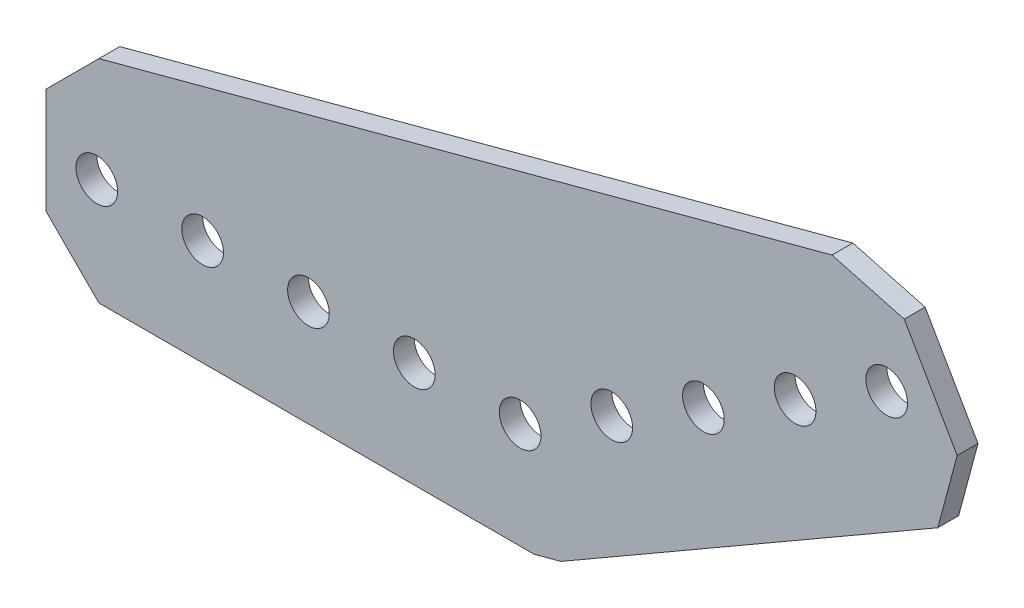
ISO-10303-21;
HEADER;
FILE_DESCRIPTION(('STEP AP214'),'2;1');
FILE_NAME('part.step','',(''),(''),'','','');
FILE_SCHEMA(('AUTOMOTIVE_DESIGN { 1 0 10303 214 1 1 1 1 }'));
ENDSEC;
DATA;
#1=APPLICATION_CONTEXT('core data for automotive mechanical design processes');
#2=APPLICATION_PROTOCOL_DEFINITION('international standard','automotive_design',2000,#1);
#3=PRODUCT_CONTEXT('',#1,'mechanical');
#4=PRODUCT('Part','Part','',(#3));
#5=PRODUCT_RELATED_PRODUCT_CATEGORY('part','',(#4));
#6=PRODUCT_DEFINITION_FORMATION('','',#4);
#7=PRODUCT_DEFINITION_CONTEXT('part definition',#1,'design');
#8=PRODUCT_DEFINITION('design','',#6,#7);
#9=PRODUCT_DEFINITION_SHAPE('','',#8);
#10=(LENGTH_UNIT() NAMED_UNIT(*) SI_UNIT(.MILLI.,.METRE.));
#11=(NAMED_UNIT(*) PLANE_ANGLE_UNIT() SI_UNIT($,.RADIAN.));
#12=(NAMED_UNIT(*) SI_UNIT($,.STERADIAN.) SOLID_ANGLE_UNIT());
#13=UNCERTAINTY_MEASURE_WITH_UNIT(LENGTH_MEASURE(1.E-05),#10,'distance_accuracy_value','');
#14=(GEOMETRIC_REPRESENTATION_CONTEXT(3) GLOBAL_UNCERTAINTY_ASSIGNED_CONTEXT((#13)) GLOBAL_UNIT_ASSIGNED_CONTEXT((#10,
#11,#12)) REPRESENTATION_CONTEXT('',''));
#15=CARTESIAN_POINT('',(0.,0.,0.));
#16=DIRECTION('',(0.,0.,1.));
#17=DIRECTION('',(1.,0.,0.));
#18=AXIS2_PLACEMENT_3D('',#15,#16,#17);
#19=CARTESIAN_POINT('',(-56.896,6.35,1.25));
#20=DIRECTION('',(-0.707106781186547,0.707106781186548,0.));
#21=DIRECTION('',(-0.707106781186548,-0.707106781186547,0.));
#22=AXIS2_PLACEMENT_3D('',#19,#20,#21);
#23=PLANE('',#22);
#24=DIRECTION('',(0.707106781186548,0.707106781186547,0.));
#25=VECTOR('',#24,1.);
#26=CARTESIAN_POINT('',(-56.896,6.35,-1.25));
#27=LINE('',#26,#25);
#28=CARTESIAN_POINT('',(-56.896,6.35,-1.25));
#29=VERTEX_POINT('',#28);
#30=CARTESIAN_POINT('',(-50.546,12.7,-1.25));
#31=VERTEX_POINT('',#30);
#32=EDGE_CURVE('E160',#29,#31,#27,.T.);
#33=ORIENTED_EDGE('',*,*,#32,.F.);
#34=DIRECTION('',(0.,0.,-1.));
#35=VECTOR('',#34,1.);
#36=CARTESIAN_POINT('',(-56.896,6.35,1.25));
#37=LINE('',#36,#35);
#38=CARTESIAN_POINT('',(-56.896,6.35,1.25));
#39=VERTEX_POINT('',#38);
#40=EDGE_CURVE('E11',#39,#29,#37,.T.);
#41=ORIENTED_EDGE('',*,*,#40,.F.);
#42=DIRECTION('',(0.707106781186548,0.707106781186547,0.));
#43=VECTOR('',#42,1.);
#44=CARTESIAN_POINT('',(-56.896,6.35,1.25));
#45=LINE('',#44,#43);
#46=CARTESIAN_POINT('',(-50.546,12.7,1.25));
#47=VERTEX_POINT('',#46);
#48=EDGE_CURVE('E197',#39,#47,#45,.T.);
#49=ORIENTED_EDGE('',*,*,#48,.T.);
#50=DIRECTION('',(0.,0.,-1.));
#51=VECTOR('',#50,1.);
#52=CARTESIAN_POINT('',(-50.546,12.7,1.25));
#53=LINE('',#52,#51);
#54=EDGE_CURVE('E48',#47,#31,#53,.T.);
#55=ORIENTED_EDGE('',*,*,#54,.T.);
#56=EDGE_LOOP('',(#33,#41,#49,#55));
#57=FACE_BOUND('',#56,.T.);
#58=ADVANCED_FACE('F45',(#57),#23,.T.);
#59=CARTESIAN_POINT('',(-56.896,-6.35,1.25));
#60=DIRECTION('',(-1.,0.,0.));
#61=DIRECTION('',(0.,0.,1.));
#62=AXIS2_PLACEMENT_3D('',#59,#60,#61);
#63=PLANE('',#62);
#64=DIRECTION('',(0.,1.,0.));
#65=VECTOR('',#64,1.);
#66=CARTESIAN_POINT('',(-56.896,-6.35,-1.25));
#67=LINE('',#66,#65);
#68=CARTESIAN_POINT('',(-56.896,-6.35,-1.25));
#69=VERTEX_POINT('',#68);
#70=EDGE_CURVE('E194',#69,#29,#67,.T.);
#71=ORIENTED_EDGE('',*,*,#70,.F.);
#72=DIRECTION('',(0.,0.,-1.));
#73=VECTOR('',#72,1.);
#74=CARTESIAN_POINT('',(-56.896,-6.35,1.25));
#75=LINE('',#74,#73);
#76=CARTESIAN_POINT('',(-56.896,-6.35,1.25));
#77=VERTEX_POINT('',#76);
#78=EDGE_CURVE('E55',#77,#69,#75,.T.);
#79=ORIENTED_EDGE('',*,*,#78,.F.);
#80=DIRECTION('',(0.,1.,0.));
#81=VECTOR('',#80,1.);
#82=CARTESIAN_POINT('',(-56.896,-6.35,1.25));
#83=LINE('',#82,#81);
#84=EDGE_CURVE('E146',#77,#39,#83,.T.);
#85=ORIENTED_EDGE('',*,*,#84,.T.);
#86=ORIENTED_EDGE('',*,*,#40,.T.);
#87=EDGE_LOOP('',(#71,#79,#85,#86));
#88=FACE_BOUND('',#87,.T.);
#89=ADVANCED_FACE('F221',(#88),#63,.T.);
#90=CARTESIAN_POINT('',(-50.546,-12.7,1.25));
#91=DIRECTION('',(-0.707106781186547,-0.707106781186548,0.));
#92=DIRECTION('',(0.707106781186548,-0.707106781186547,0.));
#93=AXIS2_PLACEMENT_3D('',#90,#91,#92);
#94=PLANE('',#93);
#95=DIRECTION('',(-0.707106781186548,0.707106781186547,0.));
#96=VECTOR('',#95,1.);
#97=CARTESIAN_POINT('',(-50.546,-12.7,-1.25));
#98=LINE('',#97,#96);
#99=CARTESIAN_POINT('',(-50.546,-12.7,-1.25));
#100=VERTEX_POINT('',#99);
#101=EDGE_CURVE('E132',#100,#69,#98,.T.);
#102=ORIENTED_EDGE('',*,*,#101,.F.);
#103=DIRECTION('',(0.,0.,-1.));
#104=VECTOR('',#103,1.);
#105=CARTESIAN_POINT('',(-50.546,-12.7,1.25));
#106=LINE('',#105,#104);
#107=CARTESIAN_POINT('',(-50.546,-12.7,1.25));
#108=VERTEX_POINT('',#107);
#109=EDGE_CURVE('E127',#108,#100,#106,.T.);
#110=ORIENTED_EDGE('',*,*,#109,.F.);
#111=DIRECTION('',(-0.707106781186548,0.707106781186547,0.));
#112=VECTOR('',#111,1.);
#113=CARTESIAN_POINT('',(-50.546,-12.7,1.25));
#114=LINE('',#113,#112);
#115=EDGE_CURVE('E130',#108,#77,#114,.T.);
#116=ORIENTED_EDGE('',*,*,#115,.T.);
#117=ORIENTED_EDGE('',*,*,#78,.T.);
#118=EDGE_LOOP('',(#102,#110,#116,#117));
#119=FACE_BOUND('',#118,.T.);
#120=ADVANCED_FACE('F129',(#119),#94,.T.);
#121=CARTESIAN_POINT('',(1.67198671935993,-12.7,1.25));
#122=DIRECTION('',(0.,-1.,0.));
#123=DIRECTION('',(0.,0.,-1.));
#124=AXIS2_PLACEMENT_3D('',#121,#122,#123);
#125=PLANE('',#124);
#126=DIRECTION('',(-1.,0.,0.));
#127=VECTOR('',#126,1.);
#128=CARTESIAN_POINT('',(1.67198671935993,-12.7,-1.25));
#129=LINE('',#128,#127);
#130=CARTESIAN_POINT('',(1.67198671935993,-12.7,-1.25));
#131=VERTEX_POINT('',#130);
#132=EDGE_CURVE('E189',#131,#100,#129,.T.);
#133=ORIENTED_EDGE('',*,*,#132,.F.);
#134=DIRECTION('',(0.,0.,-1.));
#135=VECTOR('',#134,1.);
#136=CARTESIAN_POINT('',(1.67198671935993,-12.7,1.25));
#137=LINE('',#136,#135);
#138=CARTESIAN_POINT('',(1.67198671935993,-12.7,1.25));
#139=VERTEX_POINT('',#138);
#140=EDGE_CURVE('E138',#139,#131,#137,.T.);
#141=ORIENTED_EDGE('',*,*,#140,.F.);
#142=DIRECTION('',(-1.,0.,0.));
#143=VECTOR('',#142,1.);
#144=CARTESIAN_POINT('',(1.67198671935993,-12.7,1.25));
#145=LINE('',#144,#143);
#146=EDGE_CURVE('E144',#139,#108,#145,.T.);
#147=ORIENTED_EDGE('',*,*,#146,.T.);
#148=ORIENTED_EDGE('',*,*,#109,.T.);
#149=EDGE_LOOP('',(#133,#141,#147,#148));
#150=FACE_BOUND('',#149,.T.);
#151=ADVANCED_FACE('F149',(#150),#125,.T.);
#152=CARTESIAN_POINT('',(4.9020170262441,-11.8345159877423,1.25));
#153=DIRECTION('',(0.258819045102525,-0.965925826289067,0.));
#154=DIRECTION('',(0.965925826289067,0.258819045102525,0.));
#155=AXIS2_PLACEMENT_3D('',#152,#153,#154);
#156=PLANE('',#155);
#157=DIRECTION('',(-0.965925826289067,-0.258819045102525,0.));
#158=VECTOR('',#157,1.);
#159=CARTESIAN_POINT('',(4.9020170262441,-11.8345159877423,-1.25));
#160=LINE('',#159,#158);
#161=CARTESIAN_POINT('',(4.9020170262441,-11.8345159877423,-1.25));
#162=VERTEX_POINT('',#161);
#163=EDGE_CURVE('E185',#162,#131,#160,.T.);
#164=ORIENTED_EDGE('',*,*,#163,.F.);
#165=DIRECTION('',(0.,0.,-1.));
#166=VECTOR('',#165,1.);
#167=CARTESIAN_POINT('',(4.9020170262441,-11.8345159877423,1.25));
#168=LINE('',#167,#166);
#169=CARTESIAN_POINT('',(4.9020170262441,-11.8345159877423,1.25));
#170=VERTEX_POINT('',#169);
#171=EDGE_CURVE('E203',#170,#162,#168,.T.);
#172=ORIENTED_EDGE('',*,*,#171,.F.);
#173=DIRECTION('',(-0.965925826289067,-0.258819045102525,0.));
#174=VECTOR('',#173,1.);
#175=CARTESIAN_POINT('',(4.9020170262441,-11.8345159877423,1.25));
#176=LINE('',#175,#174);
#177=EDGE_CURVE('E151',#170,#139,#176,.T.);
#178=ORIENTED_EDGE('',*,*,#177,.T.);
#179=ORIENTED_EDGE('',*,*,#140,.T.);
#180=EDGE_LOOP('',(#164,#172,#178,#179));
#181=FACE_BOUND('',#180,.T.);
#182=ADVANCED_FACE('F234',(#181),#156,.T.);
#183=CARTESIAN_POINT('',(50.1241200596882,14.2744773719375,1.25));
#184=DIRECTION('',(0.499999999999999,-0.866025403784439,0.));
#185=DIRECTION('',(0.866025403784439,0.499999999999999,0.));
#186=AXIS2_PLACEMENT_3D('',#183,#184,#185);
#187=PLANE('',#186);
#188=DIRECTION('',(-0.866025403784439,-0.499999999999999,0.));
#189=VECTOR('',#188,1.);
#190=CARTESIAN_POINT('',(50.1241200596882,14.2744773719375,-1.25));
#191=LINE('',#190,#189);
#192=CARTESIAN_POINT('',(50.1241200596882,14.2744773719375,-1.25));
#193=VERTEX_POINT('',#192);
#194=EDGE_CURVE('E181',#193,#162,#191,.T.);
#195=ORIENTED_EDGE('',*,*,#194,.F.);
#196=DIRECTION('',(0.,0.,-1.));
#197=VECTOR('',#196,1.);
#198=CARTESIAN_POINT('',(50.1241200596882,14.2744773719375,1.25));
#199=LINE('',#198,#197);
#200=CARTESIAN_POINT('',(50.1241200596882,14.2744773719375,1.25));
#201=VERTEX_POINT('',#200);
#202=EDGE_CURVE('E206',#201,#193,#199,.T.);
#203=ORIENTED_EDGE('',*,*,#202,.F.);
#204=DIRECTION('',(-0.866025403784439,-0.499999999999999,0.));
#205=VECTOR('',#204,1.);
#206=CARTESIAN_POINT('',(50.1241200596882,14.2744773719375,1.25));
#207=LINE('',#206,#205);
#208=EDGE_CURVE('E154',#201,#170,#207,.T.);
#209=ORIENTED_EDGE('',*,*,#208,.T.);
#210=ORIENTED_EDGE('',*,*,#171,.T.);
#211=EDGE_LOOP('',(#195,#203,#209,#210));
#212=FACE_BOUND('',#211,.T.);
#213=ADVANCED_FACE('F237',(#212),#187,.T.);
#214=CARTESIAN_POINT('',(52.4483813737192,22.9487386859688,1.25));
#215=DIRECTION('',(0.965925826289075,-0.258819045102496,0.));
#216=DIRECTION('',(0.258819045102496,0.965925826289075,0.));
#217=AXIS2_PLACEMENT_3D('',#214,#215,#216);
#218=PLANE('',#217);
#219=DIRECTION('',(-0.258819045102496,-0.965925826289075,0.));
#220=VECTOR('',#219,1.);
#221=CARTESIAN_POINT('',(52.4483813737192,22.9487386859688,-1.25));
#222=LINE('',#221,#220);
#223=CARTESIAN_POINT('',(52.4483813737192,22.9487386859688,-1.25));
#224=VERTEX_POINT('',#223);
#225=EDGE_CURVE('E177',#224,#193,#222,.T.);
#226=ORIENTED_EDGE('',*,*,#225,.F.);
#227=DIRECTION('',(0.,0.,-1.));
#228=VECTOR('',#227,1.);
#229=CARTESIAN_POINT('',(52.4483813737192,22.9487386859688,1.25));
#230=LINE('',#229,#228);
#231=CARTESIAN_POINT('',(52.4483813737192,22.9487386859688,1.25));
#232=VERTEX_POINT('',#231);
#233=EDGE_CURVE('E209',#232,#224,#230,.T.);
#234=ORIENTED_EDGE('',*,*,#233,.F.);
#235=DIRECTION('',(-0.258819045102496,-0.965925826289075,0.));
#236=VECTOR('',#235,1.);
#237=CARTESIAN_POINT('',(52.4483813737192,22.9487386859688,1.25));
#238=LINE('',#237,#236);
#239=EDGE_CURVE('E389',#232,#201,#238,.T.);
#240=ORIENTED_EDGE('',*,*,#239,.T.);
#241=ORIENTED_EDGE('',*,*,#202,.T.);
#242=EDGE_LOOP('',(#226,#234,#240,#241));
#243=FACE_BOUND('',#242,.T.);
#244=ADVANCED_FACE('F241',(#243),#218,.T.);
#245=CARTESIAN_POINT('',(46.0983813737194,33.9472613140308,1.25));
#246=DIRECTION('',(0.86602540378444,0.499999999999998,0.));
#247=DIRECTION('',(-0.499999999999998,0.86602540378444,0.));
#248=AXIS2_PLACEMENT_3D('',#245,#246,#247);
#249=PLANE('',#248);
#250=DIRECTION('',(0.499999999999998,-0.86602540378444,0.));
#251=VECTOR('',#250,1.);
#252=CARTESIAN_POINT('',(46.0983813737194,33.9472613140308,-1.25));
#253=LINE('',#252,#251);
#254=CARTESIAN_POINT('',(46.0983813737194,33.9472613140308,-1.25));
#255=VERTEX_POINT('',#254);
#256=EDGE_CURVE('E173',#255,#224,#253,.T.);
#257=ORIENTED_EDGE('',*,*,#256,.F.);
#258=DIRECTION('',(0.,0.,-1.));
#259=VECTOR('',#258,1.);
#260=CARTESIAN_POINT('',(46.0983813737194,33.9472613140308,1.25));
#261=LINE('',#260,#259);
#262=CARTESIAN_POINT('',(46.0983813737194,33.9472613140308,1.25));
#263=VERTEX_POINT('',#262);
#264=EDGE_CURVE('E212',#263,#255,#261,.T.);
#265=ORIENTED_EDGE('',*,*,#264,.F.);
#266=DIRECTION('',(0.499999999999998,-0.86602540378444,0.));
#267=VECTOR('',#266,1.);
#268=CARTESIAN_POINT('',(46.0983813737194,33.9472613140308,1.25));
#269=LINE('',#268,#267);
#270=EDGE_CURVE('E385',#263,#232,#269,.T.);
#271=ORIENTED_EDGE('',*,*,#270,.T.);
#272=ORIENTED_EDGE('',*,*,#233,.T.);
#273=EDGE_LOOP('',(#257,#265,#271,#272));
#274=FACE_BOUND('',#273,.T.);
#275=ADVANCED_FACE('F245',(#274),#249,.T.);
#276=CARTESIAN_POINT('',(37.4241200596881,36.2715226280624,1.25));
#277=DIRECTION('',(0.258819045102561,0.965925826289058,0.));
#278=DIRECTION('',(-0.965925826289058,0.258819045102561,0.));
#279=AXIS2_PLACEMENT_3D('',#276,#277,#278);
#280=PLANE('',#279);
#281=DIRECTION('',(0.965925826289058,-0.258819045102561,0.));
#282=VECTOR('',#281,1.);
#283=CARTESIAN_POINT('',(37.4241200596881,36.2715226280624,-1.25));
#284=LINE('',#283,#282);
#285=CARTESIAN_POINT('',(37.4241200596881,36.2715226280624,-1.25));
#286=VERTEX_POINT('',#285);
#287=EDGE_CURVE('E169',#286,#255,#284,.T.);
#288=ORIENTED_EDGE('',*,*,#287,.F.);
#289=DIRECTION('',(0.,0.,-1.));
#290=VECTOR('',#289,1.);
#291=CARTESIAN_POINT('',(37.4241200596881,36.2715226280624,1.25));
#292=LINE('',#291,#290);
#293=CARTESIAN_POINT('',(37.4241200596881,36.2715226280624,1.25));
#294=VERTEX_POINT('',#293);
#295=EDGE_CURVE('E214',#294,#286,#292,.T.);
#296=ORIENTED_EDGE('',*,*,#295,.F.);
#297=DIRECTION('',(0.965925826289058,-0.258819045102561,0.));
#298=VECTOR('',#297,1.);
#299=CARTESIAN_POINT('',(37.4241200596881,36.2715226280624,1.25));
#300=LINE('',#299,#298);
#301=EDGE_CURVE('E381',#294,#263,#300,.T.);
#302=ORIENTED_EDGE('',*,*,#301,.T.);
#303=ORIENTED_EDGE('',*,*,#264,.T.);
#304=EDGE_LOOP('',(#288,#296,#302,#303));
#305=FACE_BOUND('',#304,.T.);
#306=ADVANCED_FACE('F249',(#305),#280,.T.);
#307=CARTESIAN_POINT('',(-50.546,12.7,1.25));
#308=DIRECTION('',(-0.258819045102521,0.965925826289068,0.));
#309=DIRECTION('',(-0.965925826289068,-0.258819045102521,0.));
#310=AXIS2_PLACEMENT_3D('',#307,#308,#309);
#311=PLANE('',#310);
#312=DIRECTION('',(0.965925826289068,0.258819045102521,0.));
#313=VECTOR('',#312,1.);
#314=CARTESIAN_POINT('',(-50.546,12.7,-1.25));
#315=LINE('',#314,#313);
#316=EDGE_CURVE('E164',#31,#286,#315,.T.);
#317=ORIENTED_EDGE('',*,*,#316,.F.);
#318=ORIENTED_EDGE('',*,*,#54,.F.);
#319=DIRECTION('',(0.965925826289068,0.258819045102521,0.));
#320=VECTOR('',#319,1.);
#321=CARTESIAN_POINT('',(-50.546,12.7,1.25));
#322=LINE('',#321,#320);
#323=EDGE_CURVE('E378',#47,#294,#322,.T.);
#324=ORIENTED_EDGE('',*,*,#323,.T.);
#325=ORIENTED_EDGE('',*,*,#295,.T.);
#326=EDGE_LOOP('',(#317,#318,#324,#325));
#327=FACE_BOUND('',#326,.T.);
#328=ADVANCED_FACE('F218',(#327),#311,.T.);
#329=CARTESIAN_POINT('',(0.,0.,1.25));
#330=DIRECTION('',(0.,0.,1.));
#331=DIRECTION('',(1.,0.,0.));
#332=AXIS2_PLACEMENT_3D('',#329,#330,#331);
#333=PLANE('',#332);
#334=CARTESIAN_POINT('',(10.9985226280624,6.35,1.25));
#335=DIRECTION('',(0.,0.,-1.));
#336=DIRECTION('',(1.,0.,0.));
#337=AXIS2_PLACEMENT_3D('',#334,#335,#336);
#338=CIRCLE('',#337,2.5);
#339=CARTESIAN_POINT('',(13.4985226280624,6.35,1.25));
#340=VERTEX_POINT('',#339);
#341=EDGE_CURVE('E304',#340,#340,#338,.T.);
#342=ORIENTED_EDGE('',*,*,#341,.T.);
#343=EDGE_LOOP('',(#342));
#344=FACE_BOUND('',#343,.T.);
#345=CARTESIAN_POINT('',(21.9970452561247,12.7,1.25));
#346=DIRECTION('',(0.,0.,-1.));
#347=DIRECTION('',(1.,0.,0.));
#348=AXIS2_PLACEMENT_3D('',#345,#346,#347);
#349=CIRCLE('',#348,2.5);
#350=CARTESIAN_POINT('',(24.4970452561247,12.7,1.25));
#351=VERTEX_POINT('',#350);
#352=EDGE_CURVE('E314',#351,#351,#349,.T.);
#353=ORIENTED_EDGE('',*,*,#352,.T.);
#354=EDGE_LOOP('',(#353));
#355=FACE_BOUND('',#354,.T.);
#356=CARTESIAN_POINT('',(32.9955678841872,19.05,1.25));
#357=DIRECTION('',(0.,0.,-1.));
#358=DIRECTION('',(1.,0.,0.));
#359=AXIS2_PLACEMENT_3D('',#356,#357,#358);
#360=CIRCLE('',#359,2.5);
#361=CARTESIAN_POINT('',(35.4955678841872,19.05,1.25));
#362=VERTEX_POINT('',#361);
#363=EDGE_CURVE('E322',#362,#362,#360,.T.);
#364=ORIENTED_EDGE('',*,*,#363,.T.);
#365=EDGE_LOOP('',(#364));
#366=FACE_BOUND('',#365,.T.);
#367=CARTESIAN_POINT('',(43.9940905122495,25.4,1.25));
#368=DIRECTION('',(0.,0.,-1.));
#369=DIRECTION('',(1.,0.,0.));
#370=AXIS2_PLACEMENT_3D('',#367,#368,#369);
#371=CIRCLE('',#370,2.5);
#372=CARTESIAN_POINT('',(46.4940905122495,25.4,1.25));
#373=VERTEX_POINT('',#372);
#374=EDGE_CURVE('E330',#373,#373,#371,.T.);
#375=ORIENTED_EDGE('',*,*,#374,.T.);
#376=EDGE_LOOP('',(#375));
#377=FACE_BOUND('',#376,.T.);
#378=CARTESIAN_POINT('',(-38.1,0.,1.25));
#379=DIRECTION('',(0.,0.,-1.));
#380=DIRECTION('',(1.,0.,0.));
#381=AXIS2_PLACEMENT_3D('',#378,#379,#380);
#382=CIRCLE('',#381,2.5);
#383=CARTESIAN_POINT('',(-35.6,0.,1.25));
#384=VERTEX_POINT('',#383);
#385=EDGE_CURVE('E338',#384,#384,#382,.T.);
#386=ORIENTED_EDGE('',*,*,#385,.T.);
#387=EDGE_LOOP('',(#386));
#388=FACE_BOUND('',#387,.T.);
#389=CARTESIAN_POINT('',(-50.8,0.,1.25));
#390=DIRECTION('',(0.,0.,-1.));
#391=DIRECTION('',(1.,0.,0.));
#392=AXIS2_PLACEMENT_3D('',#389,#390,#391);
#393=CIRCLE('',#392,2.5);
#394=CARTESIAN_POINT('',(-48.3,0.,1.25));
#395=VERTEX_POINT('',#394);
#396=EDGE_CURVE('E346',#395,#395,#393,.T.);
#397=ORIENTED_EDGE('',*,*,#396,.T.);
#398=EDGE_LOOP('',(#397));
#399=FACE_BOUND('',#398,.T.);
#400=CARTESIAN_POINT('',(0.,0.,1.25));
#401=DIRECTION('',(0.,0.,-1.));
#402=DIRECTION('',(1.,0.,0.));
#403=AXIS2_PLACEMENT_3D('',#400,#401,#402);
#404=CIRCLE('',#403,2.5);
#405=CARTESIAN_POINT('',(2.5,0.,1.25));
#406=VERTEX_POINT('',#405);
#407=EDGE_CURVE('E354',#406,#406,#404,.T.);
#408=ORIENTED_EDGE('',*,*,#407,.T.);
#409=EDGE_LOOP('',(#408));
#410=FACE_BOUND('',#409,.T.);
#411=CARTESIAN_POINT('',(-25.4,0.,1.25));
#412=DIRECTION('',(0.,0.,-1.));
#413=DIRECTION('',(1.,0.,0.));
#414=AXIS2_PLACEMENT_3D('',#411,#412,#413);
#415=CIRCLE('',#414,2.5);
#416=CARTESIAN_POINT('',(-22.9,0.,1.25));
#417=VERTEX_POINT('',#416);
#418=EDGE_CURVE('E362',#417,#417,#415,.T.);
#419=ORIENTED_EDGE('',*,*,#418,.T.);
#420=EDGE_LOOP('',(#419));
#421=FACE_BOUND('',#420,.T.);
#422=CARTESIAN_POINT('',(-12.7,0.,1.25));
#423=DIRECTION('',(0.,0.,-1.));
#424=DIRECTION('',(1.,0.,0.));
#425=AXIS2_PLACEMENT_3D('',#422,#423,#424);
#426=CIRCLE('',#425,2.5);
#427=CARTESIAN_POINT('',(-10.2,0.,1.25));
#428=VERTEX_POINT('',#427);
#429=EDGE_CURVE('E165',#428,#428,#426,.T.);
#430=ORIENTED_EDGE('',*,*,#429,.T.);
#431=EDGE_LOOP('',(#430));
#432=FACE_BOUND('',#431,.T.);
#433=ORIENTED_EDGE('',*,*,#48,.F.);
#434=ORIENTED_EDGE('',*,*,#84,.F.);
#435=ORIENTED_EDGE('',*,*,#115,.F.);
#436=ORIENTED_EDGE('',*,*,#146,.F.);
#437=ORIENTED_EDGE('',*,*,#177,.F.);
#438=ORIENTED_EDGE('',*,*,#208,.F.);
#439=ORIENTED_EDGE('',*,*,#239,.F.);
#440=ORIENTED_EDGE('',*,*,#270,.F.);
#441=ORIENTED_EDGE('',*,*,#301,.F.);
#442=ORIENTED_EDGE('',*,*,#323,.F.);
#443=EDGE_LOOP('',(#433,#434,#435,#436,#437,#438,#439,#440,#441,#442));
#444=FACE_BOUND('',#443,.T.);
#445=ADVANCED_FACE('F142',(#344,#355,#366,#377,#388,#399,#410,#421,#432,#444),#333,.T.);
#446=CARTESIAN_POINT('',(0.,0.,-1.25));
#447=DIRECTION('',(0.,0.,1.));
#448=DIRECTION('',(1.,0.,0.));
#449=AXIS2_PLACEMENT_3D('',#446,#447,#448);
#450=PLANE('',#449);
#451=CARTESIAN_POINT('',(10.9985226280624,6.35,-1.25));
#452=DIRECTION('',(0.,0.,-1.));
#453=DIRECTION('',(1.,0.,0.));
#454=AXIS2_PLACEMENT_3D('',#451,#452,#453);
#455=CIRCLE('',#454,2.5);
#456=CARTESIAN_POINT('',(13.4985226280624,6.35,-1.25));
#457=VERTEX_POINT('',#456);
#458=EDGE_CURVE('E307',#457,#457,#455,.T.);
#459=ORIENTED_EDGE('',*,*,#458,.F.);
#460=EDGE_LOOP('',(#459));
#461=FACE_BOUND('',#460,.T.);
#462=CARTESIAN_POINT('',(21.9970452561247,12.7,-1.25));
#463=DIRECTION('',(0.,0.,-1.));
#464=DIRECTION('',(1.,0.,0.));
#465=AXIS2_PLACEMENT_3D('',#462,#463,#464);
#466=CIRCLE('',#465,2.5);
#467=CARTESIAN_POINT('',(24.4970452561247,12.7,-1.25));
#468=VERTEX_POINT('',#467);
#469=EDGE_CURVE('E311',#468,#468,#466,.T.);
#470=ORIENTED_EDGE('',*,*,#469,.F.);
#471=EDGE_LOOP('',(#470));
#472=FACE_BOUND('',#471,.T.);
#473=CARTESIAN_POINT('',(32.9955678841872,19.05,-1.25));
#474=DIRECTION('',(0.,0.,-1.));
#475=DIRECTION('',(1.,0.,0.));
#476=AXIS2_PLACEMENT_3D('',#473,#474,#475);
#477=CIRCLE('',#476,2.5);
#478=CARTESIAN_POINT('',(35.4955678841872,19.05,-1.25));
#479=VERTEX_POINT('',#478);
#480=EDGE_CURVE('E318',#479,#479,#477,.T.);
#481=ORIENTED_EDGE('',*,*,#480,.F.);
#482=EDGE_LOOP('',(#481));
#483=FACE_BOUND('',#482,.T.);
#484=CARTESIAN_POINT('',(43.9940905122495,25.4,-1.25));
#485=DIRECTION('',(0.,0.,-1.));
#486=DIRECTION('',(1.,0.,0.));
#487=AXIS2_PLACEMENT_3D('',#484,#485,#486);
#488=CIRCLE('',#487,2.5);
#489=CARTESIAN_POINT('',(46.4940905122495,25.4,-1.25));
#490=VERTEX_POINT('',#489);
#491=EDGE_CURVE('E326',#490,#490,#488,.T.);
#492=ORIENTED_EDGE('',*,*,#491,.F.);
#493=EDGE_LOOP('',(#492));
#494=FACE_BOUND('',#493,.T.);
#495=CARTESIAN_POINT('',(-38.1,0.,-1.25));
#496=DIRECTION('',(0.,0.,-1.));
#497=DIRECTION('',(1.,0.,0.));
#498=AXIS2_PLACEMENT_3D('',#495,#496,#497);
#499=CIRCLE('',#498,2.5);
#500=CARTESIAN_POINT('',(-35.6,0.,-1.25));
#501=VERTEX_POINT('',#500);
#502=EDGE_CURVE('E334',#501,#501,#499,.T.);
#503=ORIENTED_EDGE('',*,*,#502,.F.);
#504=EDGE_LOOP('',(#503));
#505=FACE_BOUND('',#504,.T.);
#506=CARTESIAN_POINT('',(-50.8,0.,-1.25));
#507=DIRECTION('',(0.,0.,-1.));
#508=DIRECTION('',(1.,0.,0.));
#509=AXIS2_PLACEMENT_3D('',#506,#507,#508);
#510=CIRCLE('',#509,2.5);
#511=CARTESIAN_POINT('',(-48.3,0.,-1.25));
#512=VERTEX_POINT('',#511);
#513=EDGE_CURVE('E342',#512,#512,#510,.T.);
#514=ORIENTED_EDGE('',*,*,#513,.F.);
#515=EDGE_LOOP('',(#514));
#516=FACE_BOUND('',#515,.T.);
#517=CARTESIAN_POINT('',(0.,0.,-1.25));
#518=DIRECTION('',(0.,0.,-1.));
#519=DIRECTION('',(1.,0.,0.));
#520=AXIS2_PLACEMENT_3D('',#517,#518,#519);
#521=CIRCLE('',#520,2.5);
#522=CARTESIAN_POINT('',(2.5,0.,-1.25));
#523=VERTEX_POINT('',#522);
#524=EDGE_CURVE('E350',#523,#523,#521,.T.);
#525=ORIENTED_EDGE('',*,*,#524,.F.);
#526=EDGE_LOOP('',(#525));
#527=FACE_BOUND('',#526,.T.);
#528=CARTESIAN_POINT('',(-25.4,0.,-1.25));
#529=DIRECTION('',(0.,0.,-1.));
#530=DIRECTION('',(1.,0.,0.));
#531=AXIS2_PLACEMENT_3D('',#528,#529,#530);
#532=CIRCLE('',#531,2.5);
#533=CARTESIAN_POINT('',(-22.9,0.,-1.25));
#534=VERTEX_POINT('',#533);
#535=EDGE_CURVE('E358',#534,#534,#532,.T.);
#536=ORIENTED_EDGE('',*,*,#535,.F.);
#537=EDGE_LOOP('',(#536));
#538=FACE_BOUND('',#537,.T.);
#539=CARTESIAN_POINT('',(-12.7,0.,-1.25));
#540=DIRECTION('',(0.,0.,-1.));
#541=DIRECTION('',(1.,0.,0.));
#542=AXIS2_PLACEMENT_3D('',#539,#540,#541);
#543=CIRCLE('',#542,2.5);
#544=CARTESIAN_POINT('',(-10.2,0.,-1.25));
#545=VERTEX_POINT('',#544);
#546=EDGE_CURVE('E366',#545,#545,#543,.T.);
#547=ORIENTED_EDGE('',*,*,#546,.F.);
#548=EDGE_LOOP('',(#547));
#549=FACE_BOUND('',#548,.T.);
#550=ORIENTED_EDGE('',*,*,#32,.T.);
#551=ORIENTED_EDGE('',*,*,#316,.T.);
#552=ORIENTED_EDGE('',*,*,#287,.T.);
#553=ORIENTED_EDGE('',*,*,#256,.T.);
#554=ORIENTED_EDGE('',*,*,#225,.T.);
#555=ORIENTED_EDGE('',*,*,#194,.T.);
#556=ORIENTED_EDGE('',*,*,#163,.T.);
#557=ORIENTED_EDGE('',*,*,#132,.T.);
#558=ORIENTED_EDGE('',*,*,#101,.T.);
#559=ORIENTED_EDGE('',*,*,#70,.T.);
#560=EDGE_LOOP('',(#550,#551,#552,#553,#554,#555,#556,#557,#558,#559));
#561=FACE_BOUND('',#560,.T.);
#562=ADVANCED_FACE('F220',(#461,#472,#483,#494,#505,#516,#527,#538,#549,#561),#450,.F.);
#563=CARTESIAN_POINT('',(-12.7,0.,1.25));
#564=DIRECTION('',(0.,0.,-1.));
#565=DIRECTION('',(-1.,0.,0.));
#566=AXIS2_PLACEMENT_3D('',#563,#564,#565);
#567=CYLINDRICAL_SURFACE('',#566,2.5);
#568=ORIENTED_EDGE('',*,*,#429,.F.);
#569=EDGE_LOOP('',(#568));
#570=FACE_BOUND('',#569,.T.);
#571=ORIENTED_EDGE('',*,*,#546,.T.);
#572=EDGE_LOOP('',(#571));
#573=FACE_BOUND('',#572,.T.);
#574=ADVANCED_FACE('F261',(#570,#573),#567,.F.);
#575=CARTESIAN_POINT('',(-25.4,0.,1.25));
#576=DIRECTION('',(0.,0.,-1.));
#577=DIRECTION('',(-1.,0.,0.));
#578=AXIS2_PLACEMENT_3D('',#575,#576,#577);
#579=CYLINDRICAL_SURFACE('',#578,2.5);
#580=ORIENTED_EDGE('',*,*,#418,.F.);
#581=EDGE_LOOP('',(#580));
#582=FACE_BOUND('',#581,.T.);
#583=ORIENTED_EDGE('',*,*,#535,.T.);
#584=EDGE_LOOP('',(#583));
#585=FACE_BOUND('',#584,.T.);
#586=ADVANCED_FACE('F268',(#582,#585),#579,.F.);
#587=CARTESIAN_POINT('',(0.,0.,1.25));
#588=DIRECTION('',(0.,0.,-1.));
#589=DIRECTION('',(-1.,0.,0.));
#590=AXIS2_PLACEMENT_3D('',#587,#588,#589);
#591=CYLINDRICAL_SURFACE('',#590,2.5);
#592=ORIENTED_EDGE('',*,*,#407,.F.);
#593=EDGE_LOOP('',(#592));
#594=FACE_BOUND('',#593,.T.);
#595=ORIENTED_EDGE('',*,*,#524,.T.);
#596=EDGE_LOOP('',(#595));
#597=FACE_BOUND('',#596,.T.);
#598=ADVANCED_FACE('F272',(#594,#597),#591,.F.);
#599=CARTESIAN_POINT('',(-50.8,0.,1.25));
#600=DIRECTION('',(0.,0.,-1.));
#601=DIRECTION('',(-1.,0.,0.));
#602=AXIS2_PLACEMENT_3D('',#599,#600,#601);
#603=CYLINDRICAL_SURFACE('',#602,2.5);
#604=ORIENTED_EDGE('',*,*,#396,.F.);
#605=EDGE_LOOP('',(#604));
#606=FACE_BOUND('',#605,.T.);
#607=ORIENTED_EDGE('',*,*,#513,.T.);
#608=EDGE_LOOP('',(#607));
#609=FACE_BOUND('',#608,.T.);
#610=ADVANCED_FACE('F276',(#606,#609),#603,.F.);
#611=CARTESIAN_POINT('',(-38.1,0.,1.25));
#612=DIRECTION('',(0.,0.,-1.));
#613=DIRECTION('',(-1.,0.,0.));
#614=AXIS2_PLACEMENT_3D('',#611,#612,#613);
#615=CYLINDRICAL_SURFACE('',#614,2.5);
#616=ORIENTED_EDGE('',*,*,#385,.F.);
#617=EDGE_LOOP('',(#616));
#618=FACE_BOUND('',#617,.T.);
#619=ORIENTED_EDGE('',*,*,#502,.T.);
#620=EDGE_LOOP('',(#619));
#621=FACE_BOUND('',#620,.T.);
#622=ADVANCED_FACE('F280',(#618,#621),#615,.F.);
#623=CARTESIAN_POINT('',(43.9940905122495,25.4,1.25));
#624=DIRECTION('',(0.,0.,-1.));
#625=DIRECTION('',(-1.,0.,0.));
#626=AXIS2_PLACEMENT_3D('',#623,#624,#625);
#627=CYLINDRICAL_SURFACE('',#626,2.5);
#628=ORIENTED_EDGE('',*,*,#374,.F.);
#629=EDGE_LOOP('',(#628));
#630=FACE_BOUND('',#629,.T.);
#631=ORIENTED_EDGE('',*,*,#491,.T.);
#632=EDGE_LOOP('',(#631));
#633=FACE_BOUND('',#632,.T.);
#634=ADVANCED_FACE('F284',(#630,#633),#627,.F.);
#635=CARTESIAN_POINT('',(32.9955678841872,19.05,1.25));
#636=DIRECTION('',(0.,0.,-1.));
#637=DIRECTION('',(-1.,0.,0.));
#638=AXIS2_PLACEMENT_3D('',#635,#636,#637);
#639=CYLINDRICAL_SURFACE('',#638,2.5);
#640=ORIENTED_EDGE('',*,*,#363,.F.);
#641=EDGE_LOOP('',(#640));
#642=FACE_BOUND('',#641,.T.);
#643=ORIENTED_EDGE('',*,*,#480,.T.);
#644=EDGE_LOOP('',(#643));
#645=FACE_BOUND('',#644,.T.);
#646=ADVANCED_FACE('F288',(#642,#645),#639,.F.);
#647=CARTESIAN_POINT('',(21.9970452561247,12.7,1.25));
#648=DIRECTION('',(0.,0.,-1.));
#649=DIRECTION('',(-1.,0.,0.));
#650=AXIS2_PLACEMENT_3D('',#647,#648,#649);
#651=CYLINDRICAL_SURFACE('',#650,2.5);
#652=ORIENTED_EDGE('',*,*,#352,.F.);
#653=EDGE_LOOP('',(#652));
#654=FACE_BOUND('',#653,.T.);
#655=ORIENTED_EDGE('',*,*,#469,.T.);
#656=EDGE_LOOP('',(#655));
#657=FACE_BOUND('',#656,.T.);
#658=ADVANCED_FACE('F292',(#654,#657),#651,.F.);
#659=CARTESIAN_POINT('',(10.9985226280624,6.35,1.25));
#660=DIRECTION('',(0.,0.,-1.));
#661=DIRECTION('',(-1.,0.,0.));
#662=AXIS2_PLACEMENT_3D('',#659,#660,#661);
#663=CYLINDRICAL_SURFACE('',#662,2.5);
#664=ORIENTED_EDGE('',*,*,#341,.F.);
#665=EDGE_LOOP('',(#664));
#666=FACE_BOUND('',#665,.T.);
#667=ORIENTED_EDGE('',*,*,#458,.T.);
#668=EDGE_LOOP('',(#667));
#669=FACE_BOUND('',#668,.T.);
#670=ADVANCED_FACE('F296',(#666,#669),#663,.F.);
#671=CLOSED_SHELL('',(#58,#89,#120,#151,#182,#213,#244,#275,#306,#328,#445,#562,#574,#586,#598,
#610,#622,#634,#646,#658,#670));
#672=MANIFOLD_SOLID_BREP('B2',#671);
#673=ADVANCED_BREP_SHAPE_REPRESENTATION('',(#18,#672),#14);
#674=SHAPE_DEFINITION_REPRESENTATION(#9,#673);
ENDSEC;
END-ISO-10303-21;
